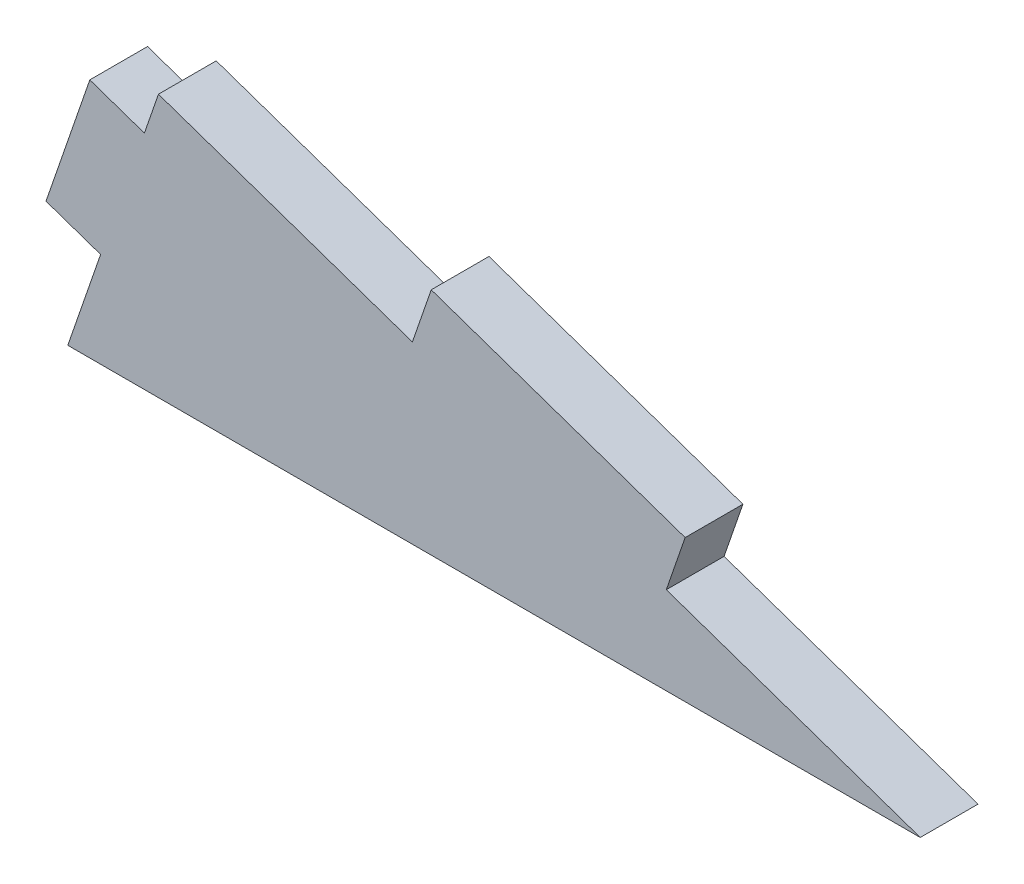
ISO-10303-21;
HEADER;
FILE_DESCRIPTION(('STEP AP214'),'2;1');
FILE_NAME('part.step','',(''),(''),'','','');
FILE_SCHEMA(('AUTOMOTIVE_DESIGN { 1 0 10303 214 1 1 1 1 }'));
ENDSEC;
DATA;
#1=APPLICATION_CONTEXT('core data for automotive mechanical design processes');
#2=APPLICATION_PROTOCOL_DEFINITION('international standard','automotive_design',2000,#1);
#3=PRODUCT_CONTEXT('',#1,'mechanical');
#4=PRODUCT('Part','Part','',(#3));
#5=PRODUCT_RELATED_PRODUCT_CATEGORY('part','',(#4));
#6=PRODUCT_DEFINITION_FORMATION('','',#4);
#7=PRODUCT_DEFINITION_CONTEXT('part definition',#1,'design');
#8=PRODUCT_DEFINITION('design','',#6,#7);
#9=PRODUCT_DEFINITION_SHAPE('','',#8);
#10=(LENGTH_UNIT() NAMED_UNIT(*) SI_UNIT(.MILLI.,.METRE.));
#11=(NAMED_UNIT(*) PLANE_ANGLE_UNIT() SI_UNIT($,.RADIAN.));
#12=(NAMED_UNIT(*) SI_UNIT($,.STERADIAN.) SOLID_ANGLE_UNIT());
#13=UNCERTAINTY_MEASURE_WITH_UNIT(LENGTH_MEASURE(1.E-05),#10,'distance_accuracy_value','');
#14=(GEOMETRIC_REPRESENTATION_CONTEXT(3) GLOBAL_UNCERTAINTY_ASSIGNED_CONTEXT((#13)) GLOBAL_UNIT_ASSIGNED_CONTEXT((#10,
#11,#12)) REPRESENTATION_CONTEXT('',''));
#15=CARTESIAN_POINT('',(0.,0.,0.));
#16=DIRECTION('',(0.,0.,1.));
#17=DIRECTION('',(1.,0.,0.));
#18=AXIS2_PLACEMENT_3D('',#15,#16,#17);
#19=CARTESIAN_POINT('',(80.6073912305813,0.,5.461));
#20=DIRECTION('',(-0.326136345546763,-0.945322740715255,0.));
#21=DIRECTION('',(0.945322740715256,-0.326136345546763,0.));
#22=AXIS2_PLACEMENT_3D('',#19,#20,#21);
#23=PLANE('',#22);
#24=DIRECTION('',(-0.945322740715256,0.326136345546763,0.));
#25=VECTOR('',#24,1.);
#26=CARTESIAN_POINT('',(80.6073912305813,0.,0.));
#27=LINE('',#26,#25);
#28=CARTESIAN_POINT('',(80.6073912305813,0.,0.));
#29=VERTEX_POINT('',#28);
#30=CARTESIAN_POINT('',(56.5961936164138,8.28386317688779,0.));
#31=VERTEX_POINT('',#30);
#32=EDGE_CURVE('E194',#29,#31,#27,.T.);
#33=ORIENTED_EDGE('',*,*,#32,.T.);
#34=DIRECTION('',(0.,0.,1.));
#35=VECTOR('',#34,1.);
#36=CARTESIAN_POINT('',(56.5961936164138,8.2838631768878,-29.08678789664));
#37=LINE('',#36,#35);
#38=CARTESIAN_POINT('',(56.5961936164138,8.28386317688779,5.461));
#39=VERTEX_POINT('',#38);
#40=EDGE_CURVE('E56',#31,#39,#37,.T.);
#41=ORIENTED_EDGE('',*,*,#40,.T.);
#42=DIRECTION('',(-0.945322740715256,0.326136345546763,0.));
#43=VECTOR('',#42,1.);
#44=CARTESIAN_POINT('',(80.6073912305813,0.,5.461));
#45=LINE('',#44,#43);
#46=CARTESIAN_POINT('',(80.6073912305813,0.,5.461));
#47=VERTEX_POINT('',#46);
#48=EDGE_CURVE('E185',#47,#39,#45,.T.);
#49=ORIENTED_EDGE('',*,*,#48,.F.);
#50=DIRECTION('',(0.,0.,-1.));
#51=VECTOR('',#50,1.);
#52=CARTESIAN_POINT('',(80.6073912305813,0.,5.461));
#53=LINE('',#52,#51);
#54=EDGE_CURVE('E41',#47,#29,#53,.T.);
#55=ORIENTED_EDGE('',*,*,#54,.T.);
#56=EDGE_LOOP('',(#33,#41,#49,#55));
#57=FACE_BOUND('',#56,.T.);
#58=ADVANCED_FACE('F33',(#57),#23,.F.);
#59=CARTESIAN_POINT('',(8.57379838807886,24.8515895306633,5.461));
#60=DIRECTION('',(0.945322740715255,-0.326136345546763,0.));
#61=DIRECTION('',(0.326136345546763,0.945322740715256,0.));
#62=AXIS2_PLACEMENT_3D('',#59,#60,#61);
#63=PLANE('',#62);
#64=DIRECTION('',(0.,0.,1.));
#65=VECTOR('',#64,1.);
#66=CARTESIAN_POINT('',(3.10230675974448,8.99219350650572,-29.08678789664));
#67=LINE('',#66,#65);
#68=CARTESIAN_POINT('',(3.10230675974448,8.99219350650572,0.));
#69=VERTEX_POINT('',#68);
#70=CARTESIAN_POINT('',(3.10230675974448,8.99219350650572,5.461));
#71=VERTEX_POINT('',#70);
#72=EDGE_CURVE('E168',#69,#71,#67,.T.);
#73=ORIENTED_EDGE('',*,*,#72,.F.);
#74=DIRECTION('',(-0.326136345546763,-0.945322740715256,0.));
#75=VECTOR('',#74,1.);
#76=CARTESIAN_POINT('',(8.57379838807886,24.8515895306633,0.));
#77=LINE('',#76,#75);
#78=CARTESIAN_POINT('',(0.,0.,0.));
#79=VERTEX_POINT('',#78);
#80=EDGE_CURVE('E179',#69,#79,#77,.T.);
#81=ORIENTED_EDGE('',*,*,#80,.T.);
#82=DIRECTION('',(0.,0.,-1.));
#83=VECTOR('',#82,1.);
#84=CARTESIAN_POINT('',(0.,0.,5.461));
#85=LINE('',#84,#83);
#86=CARTESIAN_POINT('',(0.,0.,5.461));
#87=VERTEX_POINT('',#86);
#88=EDGE_CURVE('E11',#87,#79,#85,.T.);
#89=ORIENTED_EDGE('',*,*,#88,.F.);
#90=DIRECTION('',(-0.326136345546763,-0.945322740715256,0.));
#91=VECTOR('',#90,1.);
#92=CARTESIAN_POINT('',(8.57379838807886,24.8515895306633,5.461));
#93=LINE('',#92,#91);
#94=EDGE_CURVE('E183',#71,#87,#93,.T.);
#95=ORIENTED_EDGE('',*,*,#94,.F.);
#96=EDGE_LOOP('',(#73,#81,#89,#95));
#97=FACE_BOUND('',#96,.T.);
#98=ADVANCED_FACE('F222',(#97),#63,.F.);
#99=CARTESIAN_POINT('',(8.57379838807886,24.8515895306633,0.));
#100=VERTEX_POINT('',#99);
#101=CARTESIAN_POINT('',(7.24423834818837,20.9977923135895,0.));
#102=VERTEX_POINT('',#101);
#103=EDGE_CURVE('E188',#100,#102,#77,.T.);
#104=ORIENTED_EDGE('',*,*,#103,.T.);
#105=DIRECTION('',(0.,0.,1.));
#106=VECTOR('',#105,1.);
#107=CARTESIAN_POINT('',(7.24423834818837,20.9977923135895,-29.08678789664));
#108=LINE('',#107,#106);
#109=CARTESIAN_POINT('',(7.24423834818837,20.9977923135895,5.461));
#110=VERTEX_POINT('',#109);
#111=EDGE_CURVE('E174',#102,#110,#108,.T.);
#112=ORIENTED_EDGE('',*,*,#111,.T.);
#113=CARTESIAN_POINT('',(8.57379838807886,24.8515895306633,5.461));
#114=VERTEX_POINT('',#113);
#115=EDGE_CURVE('E180',#114,#110,#93,.T.);
#116=ORIENTED_EDGE('',*,*,#115,.F.);
#117=DIRECTION('',(0.,0.,-1.));
#118=VECTOR('',#117,1.);
#119=CARTESIAN_POINT('',(8.57379838807886,24.8515895306633,5.461));
#120=LINE('',#119,#118);
#121=EDGE_CURVE('E187',#114,#100,#120,.T.);
#122=ORIENTED_EDGE('',*,*,#121,.T.);
#123=EDGE_LOOP('',(#104,#112,#116,#122));
#124=FACE_BOUND('',#123,.T.);
#125=ADVANCED_FACE('F35',(#124),#63,.F.);
#126=CARTESIAN_POINT('',(0.,0.,5.461));
#127=DIRECTION('',(0.,1.,0.));
#128=DIRECTION('',(0.,0.,1.));
#129=AXIS2_PLACEMENT_3D('',#126,#127,#128);
#130=PLANE('',#129);
#131=DIRECTION('',(1.,0.,0.));
#132=VECTOR('',#131,1.);
#133=CARTESIAN_POINT('',(0.,0.,0.));
#134=LINE('',#133,#132);
#135=EDGE_CURVE('E191',#79,#29,#134,.T.);
#136=ORIENTED_EDGE('',*,*,#135,.T.);
#137=ORIENTED_EDGE('',*,*,#54,.F.);
#138=DIRECTION('',(1.,0.,0.));
#139=VECTOR('',#138,1.);
#140=CARTESIAN_POINT('',(0.,0.,5.461));
#141=LINE('',#140,#139);
#142=EDGE_CURVE('E182',#87,#47,#141,.T.);
#143=ORIENTED_EDGE('',*,*,#142,.F.);
#144=ORIENTED_EDGE('',*,*,#88,.T.);
#145=EDGE_LOOP('',(#136,#137,#143,#144));
#146=FACE_BOUND('',#145,.T.);
#147=ADVANCED_FACE('F231',(#146),#130,.F.);
#148=CARTESIAN_POINT('',(32.5849960022464,16.5677263537756,5.461));
#149=VERTEX_POINT('',#148);
#150=EDGE_CURVE('E48',#149,#114,#45,.T.);
#151=ORIENTED_EDGE('',*,*,#150,.F.);
#152=DIRECTION('',(0.,0.,1.));
#153=VECTOR('',#152,1.);
#154=CARTESIAN_POINT('',(32.5849960022464,16.5677263537756,-29.08678789664));
#155=LINE('',#154,#153);
#156=CARTESIAN_POINT('',(32.5849960022464,16.5677263537756,0.));
#157=VERTEX_POINT('',#156);
#158=EDGE_CURVE('E133',#157,#149,#155,.T.);
#159=ORIENTED_EDGE('',*,*,#158,.F.);
#160=EDGE_CURVE('E193',#157,#100,#27,.T.);
#161=ORIENTED_EDGE('',*,*,#160,.T.);
#162=ORIENTED_EDGE('',*,*,#121,.F.);
#163=EDGE_LOOP('',(#151,#159,#161,#162));
#164=FACE_BOUND('',#163,.T.);
#165=ADVANCED_FACE('F224',(#164),#23,.F.);
#166=CARTESIAN_POINT('',(0.,0.,5.461));
#167=DIRECTION('',(0.,0.,-1.));
#168=DIRECTION('',(-1.,0.,0.));
#169=AXIS2_PLACEMENT_3D('',#166,#167,#168);
#170=PLANE('',#169);
#171=ORIENTED_EDGE('',*,*,#115,.T.);
#172=DIRECTION('',(-0.945322740715255,0.326136345546763,0.));
#173=VECTOR('',#172,1.);
#174=CARTESIAN_POINT('',(7.24423834818837,20.9977923135895,5.461));
#175=LINE('',#174,#173);
#176=CARTESIAN_POINT('',(2.08183086114236,22.7788228966203,5.461));
#177=VERTEX_POINT('',#176);
#178=EDGE_CURVE('E153',#110,#177,#175,.T.);
#179=ORIENTED_EDGE('',*,*,#178,.T.);
#180=DIRECTION('',(-0.326136345546763,-0.945322740715255,0.));
#181=VECTOR('',#180,1.);
#182=CARTESIAN_POINT('',(2.08183086114236,22.7788228966203,5.461));
#183=LINE('',#182,#181);
#184=CARTESIAN_POINT('',(-2.06010072730153,10.7732240895366,5.461));
#185=VERTEX_POINT('',#184);
#186=EDGE_CURVE('E158',#177,#185,#183,.T.);
#187=ORIENTED_EDGE('',*,*,#186,.T.);
#188=DIRECTION('',(0.945322740715255,-0.326136345546763,0.));
#189=VECTOR('',#188,1.);
#190=CARTESIAN_POINT('',(3.10230675974448,8.99219350650572,5.461));
#191=LINE('',#190,#189);
#192=EDGE_CURVE('E154',#185,#71,#191,.T.);
#193=ORIENTED_EDGE('',*,*,#192,.T.);
#194=ORIENTED_EDGE('',*,*,#94,.T.);
#195=ORIENTED_EDGE('',*,*,#142,.T.);
#196=ORIENTED_EDGE('',*,*,#48,.T.);
#197=DIRECTION('',(0.326136345546769,0.945322740715253,0.));
#198=VECTOR('',#197,1.);
#199=CARTESIAN_POINT('',(56.5961936164138,8.2838631768878,5.461));
#200=LINE('',#199,#198);
#201=CARTESIAN_POINT('',(58.3772241994447,13.4462706639338,5.461));
#202=VERTEX_POINT('',#201);
#203=EDGE_CURVE('E135',#39,#202,#200,.T.);
#204=ORIENTED_EDGE('',*,*,#203,.T.);
#205=DIRECTION('',(-0.945322740715256,0.326136345546763,0.));
#206=VECTOR('',#205,1.);
#207=CARTESIAN_POINT('',(34.3660265852772,21.7301338408216,5.461));
#208=LINE('',#207,#206);
#209=CARTESIAN_POINT('',(34.3660265852772,21.7301338408216,5.461));
#210=VERTEX_POINT('',#209);
#211=EDGE_CURVE('E124',#202,#210,#208,.T.);
#212=ORIENTED_EDGE('',*,*,#211,.T.);
#213=DIRECTION('',(-0.326136345546764,-0.945322740715255,0.));
#214=VECTOR('',#213,1.);
#215=CARTESIAN_POINT('',(32.5849960022464,16.5677263537756,5.461));
#216=LINE('',#215,#214);
#217=EDGE_CURVE('E131',#210,#149,#216,.T.);
#218=ORIENTED_EDGE('',*,*,#217,.T.);
#219=ORIENTED_EDGE('',*,*,#150,.T.);
#220=EDGE_LOOP('',(#171,#179,#187,#193,#194,#195,#196,#204,#212,#218,#219));
#221=FACE_BOUND('',#220,.T.);
#222=ADVANCED_FACE('F139',(#221),#170,.F.);
#223=CARTESIAN_POINT('',(0.,0.,0.));
#224=DIRECTION('',(0.,0.,-1.));
#225=DIRECTION('',(-1.,0.,0.));
#226=AXIS2_PLACEMENT_3D('',#223,#224,#225);
#227=PLANE('',#226);
#228=ORIENTED_EDGE('',*,*,#103,.F.);
#229=ORIENTED_EDGE('',*,*,#160,.F.);
#230=DIRECTION('',(-0.326136345546764,-0.945322740715255,0.));
#231=VECTOR('',#230,1.);
#232=CARTESIAN_POINT('',(32.5849960022464,16.5677263537756,0.));
#233=LINE('',#232,#231);
#234=CARTESIAN_POINT('',(34.3660265852772,21.7301338408216,0.));
#235=VERTEX_POINT('',#234);
#236=EDGE_CURVE('E128',#235,#157,#233,.T.);
#237=ORIENTED_EDGE('',*,*,#236,.F.);
#238=DIRECTION('',(-0.945322740715256,0.326136345546763,0.));
#239=VECTOR('',#238,1.);
#240=CARTESIAN_POINT('',(34.3660265852772,21.7301338408216,0.));
#241=LINE('',#240,#239);
#242=CARTESIAN_POINT('',(58.3772241994447,13.4462706639338,0.));
#243=VERTEX_POINT('',#242);
#244=EDGE_CURVE('E125',#243,#235,#241,.T.);
#245=ORIENTED_EDGE('',*,*,#244,.F.);
#246=DIRECTION('',(0.326136345546769,0.945322740715253,0.));
#247=VECTOR('',#246,1.);
#248=CARTESIAN_POINT('',(56.5961936164138,8.2838631768878,0.));
#249=LINE('',#248,#247);
#250=EDGE_CURVE('E142',#31,#243,#249,.T.);
#251=ORIENTED_EDGE('',*,*,#250,.F.);
#252=ORIENTED_EDGE('',*,*,#32,.F.);
#253=ORIENTED_EDGE('',*,*,#135,.F.);
#254=ORIENTED_EDGE('',*,*,#80,.F.);
#255=DIRECTION('',(0.945322740715256,-0.326136345546763,0.));
#256=VECTOR('',#255,1.);
#257=CARTESIAN_POINT('',(3.10230675974448,8.99219350650572,0.));
#258=LINE('',#257,#256);
#259=CARTESIAN_POINT('',(-2.06010072730153,10.7732240895366,0.));
#260=VERTEX_POINT('',#259);
#261=EDGE_CURVE('E166',#260,#69,#258,.T.);
#262=ORIENTED_EDGE('',*,*,#261,.F.);
#263=DIRECTION('',(-0.326136345546763,-0.945322740715256,0.));
#264=VECTOR('',#263,1.);
#265=CARTESIAN_POINT('',(2.08183086114236,22.7788228966203,0.));
#266=LINE('',#265,#264);
#267=CARTESIAN_POINT('',(2.08183086114236,22.7788228966203,0.));
#268=VERTEX_POINT('',#267);
#269=EDGE_CURVE('E170',#268,#260,#266,.T.);
#270=ORIENTED_EDGE('',*,*,#269,.F.);
#271=DIRECTION('',(-0.945322740715256,0.326136345546763,0.));
#272=VECTOR('',#271,1.);
#273=CARTESIAN_POINT('',(7.24423834818837,20.9977923135895,0.));
#274=LINE('',#273,#272);
#275=EDGE_CURVE('E157',#102,#268,#274,.T.);
#276=ORIENTED_EDGE('',*,*,#275,.F.);
#277=EDGE_LOOP('',(#228,#229,#237,#245,#251,#252,#253,#254,#262,#270,#276));
#278=FACE_BOUND('',#277,.T.);
#279=ADVANCED_FACE('F206',(#278),#227,.T.);
#280=CARTESIAN_POINT('',(7.24423834818837,20.9977923135895,-29.08678789664));
#281=DIRECTION('',(0.326136345546763,0.945322740715256,0.));
#282=DIRECTION('',(-0.945322740715256,0.326136345546763,0.));
#283=AXIS2_PLACEMENT_3D('',#280,#281,#282);
#284=PLANE('',#283);
#285=ORIENTED_EDGE('',*,*,#111,.F.);
#286=ORIENTED_EDGE('',*,*,#275,.T.);
#287=DIRECTION('',(0.,0.,1.));
#288=VECTOR('',#287,1.);
#289=CARTESIAN_POINT('',(2.08183086114236,22.7788228966203,-29.08678789664));
#290=LINE('',#289,#288);
#291=EDGE_CURVE('E165',#268,#177,#290,.T.);
#292=ORIENTED_EDGE('',*,*,#291,.T.);
#293=ORIENTED_EDGE('',*,*,#178,.F.);
#294=EDGE_LOOP('',(#285,#286,#292,#293));
#295=FACE_BOUND('',#294,.T.);
#296=ADVANCED_FACE('F251',(#295),#284,.T.);
#297=CARTESIAN_POINT('',(2.08183086114236,22.7788228966203,-29.08678789664));
#298=DIRECTION('',(-0.945322740715255,0.326136345546763,0.));
#299=DIRECTION('',(-0.326136345546763,-0.945322740715256,0.));
#300=AXIS2_PLACEMENT_3D('',#297,#298,#299);
#301=PLANE('',#300);
#302=ORIENTED_EDGE('',*,*,#291,.F.);
#303=ORIENTED_EDGE('',*,*,#269,.T.);
#304=DIRECTION('',(0.,0.,1.));
#305=VECTOR('',#304,1.);
#306=CARTESIAN_POINT('',(-2.06010072730153,10.7732240895366,-29.08678789664));
#307=LINE('',#306,#305);
#308=EDGE_CURVE('E169',#260,#185,#307,.T.);
#309=ORIENTED_EDGE('',*,*,#308,.T.);
#310=ORIENTED_EDGE('',*,*,#186,.F.);
#311=EDGE_LOOP('',(#302,#303,#309,#310));
#312=FACE_BOUND('',#311,.T.);
#313=ADVANCED_FACE('F218',(#312),#301,.T.);
#314=CARTESIAN_POINT('',(3.10230675974448,8.99219350650572,-29.08678789664));
#315=DIRECTION('',(-0.326136345546763,-0.945322740715255,0.));
#316=DIRECTION('',(0.945322740715256,-0.326136345546763,0.));
#317=AXIS2_PLACEMENT_3D('',#314,#315,#316);
#318=PLANE('',#317);
#319=ORIENTED_EDGE('',*,*,#308,.F.);
#320=ORIENTED_EDGE('',*,*,#261,.T.);
#321=ORIENTED_EDGE('',*,*,#72,.T.);
#322=ORIENTED_EDGE('',*,*,#192,.F.);
#323=EDGE_LOOP('',(#319,#320,#321,#322));
#324=FACE_BOUND('',#323,.T.);
#325=ADVANCED_FACE('F211',(#324),#318,.T.);
#326=CARTESIAN_POINT('',(56.5961936164138,8.2838631768878,-29.08678789664));
#327=DIRECTION('',(0.945322740715253,-0.326136345546769,0.));
#328=DIRECTION('',(0.326136345546769,0.945322740715253,0.));
#329=AXIS2_PLACEMENT_3D('',#326,#327,#328);
#330=PLANE('',#329);
#331=ORIENTED_EDGE('',*,*,#40,.F.);
#332=ORIENTED_EDGE('',*,*,#250,.T.);
#333=DIRECTION('',(0.,0.,1.));
#334=VECTOR('',#333,1.);
#335=CARTESIAN_POINT('',(58.3772241994447,13.4462706639338,-29.08678789664));
#336=LINE('',#335,#334);
#337=EDGE_CURVE('E148',#243,#202,#336,.T.);
#338=ORIENTED_EDGE('',*,*,#337,.T.);
#339=ORIENTED_EDGE('',*,*,#203,.F.);
#340=EDGE_LOOP('',(#331,#332,#338,#339));
#341=FACE_BOUND('',#340,.T.);
#342=ADVANCED_FACE('F209',(#341),#330,.T.);
#343=CARTESIAN_POINT('',(34.3660265852772,21.7301338408216,-29.08678789664));
#344=DIRECTION('',(0.326136345546763,0.945322740715255,0.));
#345=DIRECTION('',(-0.945322740715256,0.326136345546763,0.));
#346=AXIS2_PLACEMENT_3D('',#343,#344,#345);
#347=PLANE('',#346);
#348=ORIENTED_EDGE('',*,*,#337,.F.);
#349=ORIENTED_EDGE('',*,*,#244,.T.);
#350=DIRECTION('',(0.,0.,1.));
#351=VECTOR('',#350,1.);
#352=CARTESIAN_POINT('',(34.3660265852772,21.7301338408216,-29.08678789664));
#353=LINE('',#352,#351);
#354=EDGE_CURVE('E119',#235,#210,#353,.T.);
#355=ORIENTED_EDGE('',*,*,#354,.T.);
#356=ORIENTED_EDGE('',*,*,#211,.F.);
#357=EDGE_LOOP('',(#348,#349,#355,#356));
#358=FACE_BOUND('',#357,.T.);
#359=ADVANCED_FACE('F122',(#358),#347,.T.);
#360=CARTESIAN_POINT('',(32.5849960022464,16.5677263537756,-29.08678789664));
#361=DIRECTION('',(-0.945322740715255,0.326136345546764,0.));
#362=DIRECTION('',(-0.326136345546764,-0.945322740715255,0.));
#363=AXIS2_PLACEMENT_3D('',#360,#361,#362);
#364=PLANE('',#363);
#365=ORIENTED_EDGE('',*,*,#354,.F.);
#366=ORIENTED_EDGE('',*,*,#236,.T.);
#367=ORIENTED_EDGE('',*,*,#158,.T.);
#368=ORIENTED_EDGE('',*,*,#217,.F.);
#369=EDGE_LOOP('',(#365,#366,#367,#368));
#370=FACE_BOUND('',#369,.T.);
#371=ADVANCED_FACE('F132',(#370),#364,.T.);
#372=CLOSED_SHELL('',(#58,#98,#125,#147,#165,#222,#279,#296,#313,#325,#342,#359,#371));
#373=MANIFOLD_SOLID_BREP('B2',#372);
#374=ADVANCED_BREP_SHAPE_REPRESENTATION('',(#18,#373),#14);
#375=SHAPE_DEFINITION_REPRESENTATION(#9,#374);
ENDSEC;
END-ISO-10303-21;
